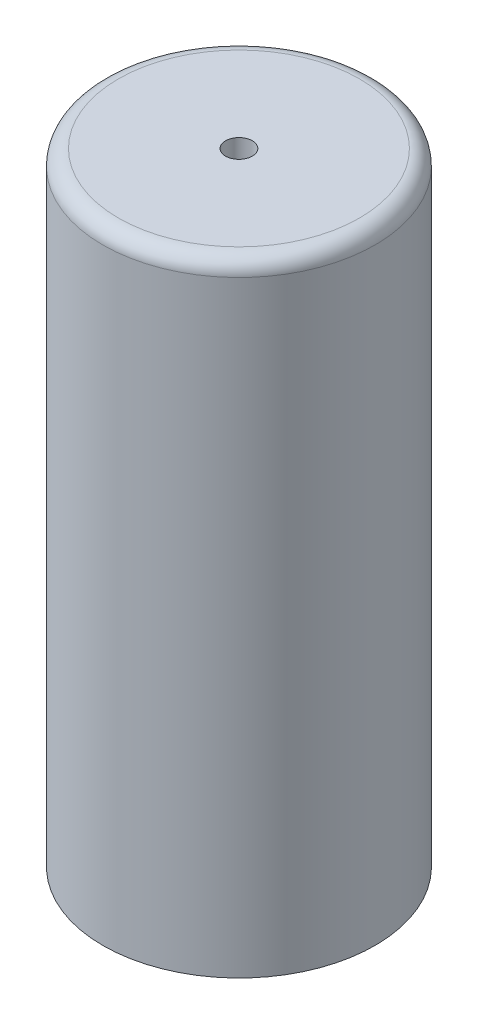
ISO-10303-21;
HEADER;
FILE_DESCRIPTION(('STEP AP214'),'2;1');
FILE_NAME('part.step','',(''),(''),'','','');
FILE_SCHEMA(('AUTOMOTIVE_DESIGN { 1 0 10303 214 1 1 1 1 }'));
ENDSEC;
DATA;
#1=APPLICATION_CONTEXT('core data for automotive mechanical design processes');
#2=APPLICATION_PROTOCOL_DEFINITION('international standard','automotive_design',2000,#1);
#3=PRODUCT_CONTEXT('',#1,'mechanical');
#4=PRODUCT('Part','Part','',(#3));
#5=PRODUCT_RELATED_PRODUCT_CATEGORY('part','',(#4));
#6=PRODUCT_DEFINITION_FORMATION('','',#4);
#7=PRODUCT_DEFINITION_CONTEXT('part definition',#1,'design');
#8=PRODUCT_DEFINITION('design','',#6,#7);
#9=PRODUCT_DEFINITION_SHAPE('','',#8);
#10=(LENGTH_UNIT() NAMED_UNIT(*) SI_UNIT(.MILLI.,.METRE.));
#11=(NAMED_UNIT(*) PLANE_ANGLE_UNIT() SI_UNIT($,.RADIAN.));
#12=(NAMED_UNIT(*) SI_UNIT($,.STERADIAN.) SOLID_ANGLE_UNIT());
#13=UNCERTAINTY_MEASURE_WITH_UNIT(LENGTH_MEASURE(1.E-05),#10,'distance_accuracy_value','');
#14=(GEOMETRIC_REPRESENTATION_CONTEXT(3) GLOBAL_UNCERTAINTY_ASSIGNED_CONTEXT((#13)) GLOBAL_UNIT_ASSIGNED_CONTEXT((#10,
#11,#12)) REPRESENTATION_CONTEXT('',''));
#15=CARTESIAN_POINT('',(0.,0.,0.));
#16=DIRECTION('',(0.,0.,1.));
#17=DIRECTION('',(1.,0.,0.));
#18=AXIS2_PLACEMENT_3D('',#15,#16,#17);
#19=CARTESIAN_POINT('',(0.,101.6,0.));
#20=DIRECTION('',(0.,-1.,0.));
#21=DIRECTION('',(0.,0.,-1.));
#22=AXIS2_PLACEMENT_3D('',#19,#20,#21);
#23=CYLINDRICAL_SURFACE('',#22,22.225);
#24=CARTESIAN_POINT('',(0.,99.06,0.));
#25=DIRECTION('',(0.,1.,0.));
#26=DIRECTION('',(0.,0.,1.));
#27=AXIS2_PLACEMENT_3D('',#24,#25,#26);
#28=CIRCLE('',#27,22.225);
#29=CARTESIAN_POINT('',(0.,99.06,22.225));
#30=VERTEX_POINT('',#29);
#31=EDGE_CURVE('E10',#30,#30,#28,.F.);
#32=ORIENTED_EDGE('',*,*,#31,.T.);
#33=EDGE_LOOP('',(#32));
#34=FACE_BOUND('',#33,.T.);
#35=CARTESIAN_POINT('',(0.,0.,0.));
#36=DIRECTION('',(0.,1.,0.));
#37=DIRECTION('',(0.,0.,1.));
#38=AXIS2_PLACEMENT_3D('',#35,#36,#37);
#39=CIRCLE('',#38,22.225);
#40=CARTESIAN_POINT('',(0.,0.,22.225));
#41=VERTEX_POINT('',#40);
#42=EDGE_CURVE('E55',#41,#41,#39,.T.);
#43=ORIENTED_EDGE('',*,*,#42,.T.);
#44=EDGE_LOOP('',(#43));
#45=FACE_BOUND('',#44,.T.);
#46=ADVANCED_FACE('F42',(#34,#45),#23,.T.);
#47=CARTESIAN_POINT('',(0.,101.6,0.));
#48=DIRECTION('',(0.,1.,0.));
#49=DIRECTION('',(0.,0.,1.));
#50=AXIS2_PLACEMENT_3D('',#47,#48,#49);
#51=PLANE('',#50);
#52=CARTESIAN_POINT('',(0.,101.6,0.));
#53=DIRECTION('',(0.,1.,0.));
#54=DIRECTION('',(0.,0.,1.));
#55=AXIS2_PLACEMENT_3D('',#52,#53,#54);
#56=CIRCLE('',#55,2.1828125);
#57=CARTESIAN_POINT('',(0.,101.6,2.1828125));
#58=VERTEX_POINT('',#57);
#59=EDGE_CURVE('E63',#58,#58,#56,.T.);
#60=ORIENTED_EDGE('',*,*,#59,.F.);
#61=EDGE_LOOP('',(#60));
#62=FACE_BOUND('',#61,.T.);
#63=CARTESIAN_POINT('',(0.,101.6,0.));
#64=DIRECTION('',(0.,1.,0.));
#65=DIRECTION('',(0.,0.,1.));
#66=AXIS2_PLACEMENT_3D('',#63,#64,#65);
#67=CIRCLE('',#66,19.685);
#68=CARTESIAN_POINT('',(0.,101.6,19.685));
#69=VERTEX_POINT('',#68);
#70=EDGE_CURVE('E50',#69,#69,#67,.T.);
#71=ORIENTED_EDGE('',*,*,#70,.T.);
#72=EDGE_LOOP('',(#71));
#73=FACE_BOUND('',#72,.T.);
#74=ADVANCED_FACE('F79',(#62,#73),#51,.T.);
#75=CARTESIAN_POINT('',(0.,0.,0.));
#76=DIRECTION('',(0.,1.,0.));
#77=DIRECTION('',(0.,0.,1.));
#78=AXIS2_PLACEMENT_3D('',#75,#76,#77);
#79=PLANE('',#78);
#80=ORIENTED_EDGE('',*,*,#42,.F.);
#81=EDGE_LOOP('',(#80));
#82=FACE_BOUND('',#81,.T.);
#83=ADVANCED_FACE('F81',(#82),#79,.F.);
#84=CARTESIAN_POINT('',(0.,99.06,0.));
#85=DIRECTION('',(0.,1.,0.));
#86=DIRECTION('',(0.,0.,1.));
#87=AXIS2_PLACEMENT_3D('',#84,#85,#86);
#88=TOROIDAL_SURFACE('',#87,19.685,2.54);
#89=ORIENTED_EDGE('',*,*,#31,.F.);
#90=EDGE_LOOP('',(#89));
#91=FACE_BOUND('',#90,.T.);
#92=ORIENTED_EDGE('',*,*,#70,.F.);
#93=EDGE_LOOP('',(#92));
#94=FACE_BOUND('',#93,.T.);
#95=ADVANCED_FACE('F44',(#91,#94),#88,.T.);
#96=CARTESIAN_POINT('',(0.,94.742,0.));
#97=DIRECTION('',(0.,1.,0.));
#98=DIRECTION('',(0.,0.,1.));
#99=AXIS2_PLACEMENT_3D('',#96,#97,#98);
#100=CYLINDRICAL_SURFACE('',#99,2.1828125);
#101=CARTESIAN_POINT('',(0.,94.742,0.));
#102=DIRECTION('',(0.,1.,0.));
#103=DIRECTION('',(0.,0.,1.));
#104=AXIS2_PLACEMENT_3D('',#101,#102,#103);
#105=CIRCLE('',#104,2.1828125);
#106=CARTESIAN_POINT('',(0.,94.742,2.1828125));
#107=VERTEX_POINT('',#106);
#108=EDGE_CURVE('E60',#107,#107,#105,.T.);
#109=ORIENTED_EDGE('',*,*,#108,.F.);
#110=EDGE_LOOP('',(#109));
#111=FACE_BOUND('',#110,.T.);
#112=ORIENTED_EDGE('',*,*,#59,.T.);
#113=EDGE_LOOP('',(#112));
#114=FACE_BOUND('',#113,.T.);
#115=ADVANCED_FACE('F73',(#111,#114),#100,.F.);
#116=CARTESIAN_POINT('',(0.,94.742,0.));
#117=DIRECTION('',(0.,1.,0.));
#118=DIRECTION('',(0.,0.,1.));
#119=AXIS2_PLACEMENT_3D('',#116,#117,#118);
#120=PLANE('',#119);
#121=ORIENTED_EDGE('',*,*,#108,.T.);
#122=EDGE_LOOP('',(#121));
#123=FACE_BOUND('',#122,.T.);
#124=ADVANCED_FACE('F71',(#123),#120,.T.);
#125=CLOSED_SHELL('',(#46,#74,#83,#95,#115,#124));
#126=MANIFOLD_SOLID_BREP('B2',#125);
#127=ADVANCED_BREP_SHAPE_REPRESENTATION('',(#18,#126),#14);
#128=SHAPE_DEFINITION_REPRESENTATION(#9,#127);
ENDSEC;
END-ISO-10303-21;
